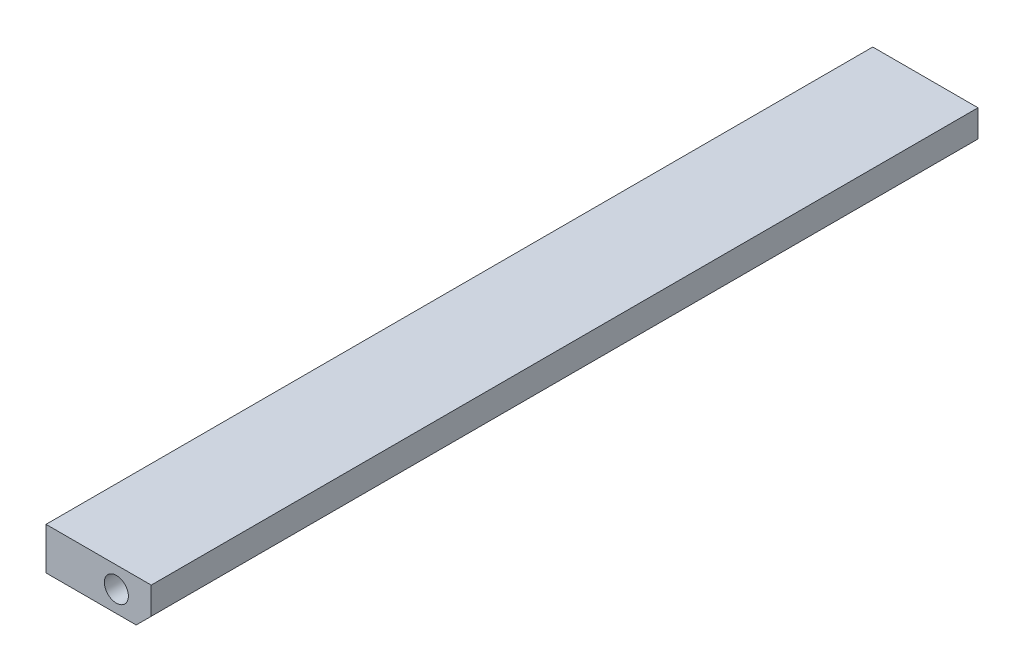
ISO-10303-21;
HEADER;
FILE_DESCRIPTION(('STEP AP214'),'2;1');
FILE_NAME('part.step','',(''),(''),'','','');
FILE_SCHEMA(('AUTOMOTIVE_DESIGN { 1 0 10303 214 1 1 1 1 }'));
ENDSEC;
DATA;
#1=APPLICATION_CONTEXT('core data for automotive mechanical design processes');
#2=APPLICATION_PROTOCOL_DEFINITION('international standard','automotive_design',2000,#1);
#3=PRODUCT_CONTEXT('',#1,'mechanical');
#4=PRODUCT('Part','Part','',(#3));
#5=PRODUCT_RELATED_PRODUCT_CATEGORY('part','',(#4));
#6=PRODUCT_DEFINITION_FORMATION('','',#4);
#7=PRODUCT_DEFINITION_CONTEXT('part definition',#1,'design');
#8=PRODUCT_DEFINITION('design','',#6,#7);
#9=PRODUCT_DEFINITION_SHAPE('','',#8);
#10=(LENGTH_UNIT() NAMED_UNIT(*) SI_UNIT(.MILLI.,.METRE.));
#11=(NAMED_UNIT(*) PLANE_ANGLE_UNIT() SI_UNIT($,.RADIAN.));
#12=(NAMED_UNIT(*) SI_UNIT($,.STERADIAN.) SOLID_ANGLE_UNIT());
#13=UNCERTAINTY_MEASURE_WITH_UNIT(LENGTH_MEASURE(1.E-05),#10,'distance_accuracy_value','');
#14=(GEOMETRIC_REPRESENTATION_CONTEXT(3) GLOBAL_UNCERTAINTY_ASSIGNED_CONTEXT((#13)) GLOBAL_UNIT_ASSIGNED_CONTEXT((#10,
#11,#12)) REPRESENTATION_CONTEXT('',''));
#15=CARTESIAN_POINT('',(0.,0.,0.));
#16=DIRECTION('',(0.,0.,1.));
#17=DIRECTION('',(1.,0.,0.));
#18=AXIS2_PLACEMENT_3D('',#15,#16,#17);
#19=CARTESIAN_POINT('',(17.5,-7.,275.));
#20=DIRECTION('',(-1.,0.,0.));
#21=DIRECTION('',(0.,0.,1.));
#22=AXIS2_PLACEMENT_3D('',#19,#20,#21);
#23=PLANE('',#22);
#24=DIRECTION('',(0.,1.,0.));
#25=VECTOR('',#24,1.);
#26=CARTESIAN_POINT('',(17.5,-7.,275.));
#27=LINE('',#26,#25);
#28=CARTESIAN_POINT('',(17.5,-1.99999999999994,275.));
#29=VERTEX_POINT('',#28);
#30=CARTESIAN_POINT('',(17.5,7.,275.));
#31=VERTEX_POINT('',#30);
#32=EDGE_CURVE('E81',#29,#31,#27,.T.);
#33=ORIENTED_EDGE('',*,*,#32,.F.);
#34=DIRECTION('',(0.,0.,-1.));
#35=VECTOR('',#34,1.);
#36=CARTESIAN_POINT('',(17.5,-1.99999999999994,275.));
#37=LINE('',#36,#35);
#38=CARTESIAN_POINT('',(17.5,-1.99999999999994,0.));
#39=VERTEX_POINT('',#38);
#40=EDGE_CURVE('E104',#29,#39,#37,.T.);
#41=ORIENTED_EDGE('',*,*,#40,.T.);
#42=DIRECTION('',(0.,1.,0.));
#43=VECTOR('',#42,1.);
#44=CARTESIAN_POINT('',(17.5,-7.,0.));
#45=LINE('',#44,#43);
#46=CARTESIAN_POINT('',(17.5,7.,0.));
#47=VERTEX_POINT('',#46);
#48=EDGE_CURVE('E102',#39,#47,#45,.T.);
#49=ORIENTED_EDGE('',*,*,#48,.T.);
#50=DIRECTION('',(0.,0.,-1.));
#51=VECTOR('',#50,1.);
#52=CARTESIAN_POINT('',(17.5,7.,275.));
#53=LINE('',#52,#51);
#54=EDGE_CURVE('E96',#31,#47,#53,.T.);
#55=ORIENTED_EDGE('',*,*,#54,.F.);
#56=EDGE_LOOP('',(#33,#41,#49,#55));
#57=FACE_BOUND('',#56,.T.);
#58=ADVANCED_FACE('F35',(#57),#23,.F.);
#59=CARTESIAN_POINT('',(-17.5,7.,275.));
#60=DIRECTION('',(0.,-1.,0.));
#61=DIRECTION('',(0.,0.,-1.));
#62=AXIS2_PLACEMENT_3D('',#59,#60,#61);
#63=PLANE('',#62);
#64=DIRECTION('',(-1.,0.,0.));
#65=VECTOR('',#64,1.);
#66=CARTESIAN_POINT('',(-17.5,7.,0.));
#67=LINE('',#66,#65);
#68=CARTESIAN_POINT('',(-17.5,7.,0.));
#69=VERTEX_POINT('',#68);
#70=EDGE_CURVE('E117',#47,#69,#67,.T.);
#71=ORIENTED_EDGE('',*,*,#70,.T.);
#72=DIRECTION('',(0.,0.,-1.));
#73=VECTOR('',#72,1.);
#74=CARTESIAN_POINT('',(-17.5,7.,275.));
#75=LINE('',#74,#73);
#76=CARTESIAN_POINT('',(-17.5,7.,275.));
#77=VERTEX_POINT('',#76);
#78=EDGE_CURVE('E98',#77,#69,#75,.T.);
#79=ORIENTED_EDGE('',*,*,#78,.F.);
#80=DIRECTION('',(-1.,0.,0.));
#81=VECTOR('',#80,1.);
#82=CARTESIAN_POINT('',(-17.5,7.,275.));
#83=LINE('',#82,#81);
#84=EDGE_CURVE('E84',#31,#77,#83,.T.);
#85=ORIENTED_EDGE('',*,*,#84,.F.);
#86=ORIENTED_EDGE('',*,*,#54,.T.);
#87=EDGE_LOOP('',(#71,#79,#85,#86));
#88=FACE_BOUND('',#87,.T.);
#89=ADVANCED_FACE('F95',(#88),#63,.F.);
#90=CARTESIAN_POINT('',(-17.5,-7.,275.));
#91=DIRECTION('',(1.,0.,0.));
#92=DIRECTION('',(0.,0.,-1.));
#93=AXIS2_PLACEMENT_3D('',#90,#91,#92);
#94=PLANE('',#93);
#95=DIRECTION('',(0.,-1.,0.));
#96=VECTOR('',#95,1.);
#97=CARTESIAN_POINT('',(-17.5,-7.,0.));
#98=LINE('',#97,#96);
#99=CARTESIAN_POINT('',(-17.5,-7.,0.));
#100=VERTEX_POINT('',#99);
#101=EDGE_CURVE('E115',#69,#100,#98,.T.);
#102=ORIENTED_EDGE('',*,*,#101,.T.);
#103=DIRECTION('',(0.,0.,-1.));
#104=VECTOR('',#103,1.);
#105=CARTESIAN_POINT('',(-17.5,-7.,275.));
#106=LINE('',#105,#104);
#107=CARTESIAN_POINT('',(-17.5,-7.,275.));
#108=VERTEX_POINT('',#107);
#109=EDGE_CURVE('E107',#108,#100,#106,.T.);
#110=ORIENTED_EDGE('',*,*,#109,.F.);
#111=DIRECTION('',(0.,-1.,0.));
#112=VECTOR('',#111,1.);
#113=CARTESIAN_POINT('',(-17.5,-7.,275.));
#114=LINE('',#113,#112);
#115=EDGE_CURVE('E100',#77,#108,#114,.T.);
#116=ORIENTED_EDGE('',*,*,#115,.F.);
#117=ORIENTED_EDGE('',*,*,#78,.T.);
#118=EDGE_LOOP('',(#102,#110,#116,#117));
#119=FACE_BOUND('',#118,.T.);
#120=ADVANCED_FACE('F150',(#119),#94,.F.);
#121=CARTESIAN_POINT('',(-17.5,-7.,275.));
#122=DIRECTION('',(0.,1.,0.));
#123=DIRECTION('',(0.,0.,1.));
#124=AXIS2_PLACEMENT_3D('',#121,#122,#123);
#125=PLANE('',#124);
#126=DIRECTION('',(1.,0.,0.));
#127=VECTOR('',#126,1.);
#128=CARTESIAN_POINT('',(-17.5,-7.,0.));
#129=LINE('',#128,#127);
#130=CARTESIAN_POINT('',(12.4999999999999,-7.,0.));
#131=VERTEX_POINT('',#130);
#132=EDGE_CURVE('E91',#100,#131,#129,.T.);
#133=ORIENTED_EDGE('',*,*,#132,.T.);
#134=DIRECTION('',(0.,0.,1.));
#135=VECTOR('',#134,1.);
#136=CARTESIAN_POINT('',(12.4999999999999,-7.,275.));
#137=LINE('',#136,#135);
#138=CARTESIAN_POINT('',(12.4999999999999,-7.,275.));
#139=VERTEX_POINT('',#138);
#140=EDGE_CURVE('E43',#131,#139,#137,.T.);
#141=ORIENTED_EDGE('',*,*,#140,.T.);
#142=DIRECTION('',(1.,0.,0.));
#143=VECTOR('',#142,1.);
#144=CARTESIAN_POINT('',(-17.5,-7.,275.));
#145=LINE('',#144,#143);
#146=EDGE_CURVE('E113',#108,#139,#145,.T.);
#147=ORIENTED_EDGE('',*,*,#146,.F.);
#148=ORIENTED_EDGE('',*,*,#109,.T.);
#149=EDGE_LOOP('',(#133,#141,#147,#148));
#150=FACE_BOUND('',#149,.T.);
#151=ADVANCED_FACE('F155',(#150),#125,.F.);
#152=CARTESIAN_POINT('',(0.,0.,275.));
#153=DIRECTION('',(0.,0.,-1.));
#154=DIRECTION('',(-1.,0.,0.));
#155=AXIS2_PLACEMENT_3D('',#152,#153,#154);
#156=PLANE('',#155);
#157=CARTESIAN_POINT('',(5.89999999999999,0.,275.));
#158=DIRECTION('',(0.,0.,1.));
#159=DIRECTION('',(1.,0.,0.));
#160=AXIS2_PLACEMENT_3D('',#157,#158,#159);
#161=CIRCLE('',#160,4.);
#162=CARTESIAN_POINT('',(9.89999999999999,0.,275.));
#163=VERTEX_POINT('',#162);
#164=EDGE_CURVE('E123',#163,#163,#161,.T.);
#165=ORIENTED_EDGE('',*,*,#164,.F.);
#166=EDGE_LOOP('',(#165));
#167=FACE_BOUND('',#166,.T.);
#168=ORIENTED_EDGE('',*,*,#146,.T.);
#169=DIRECTION('',(-0.70710678118655,-0.707106781186546,0.));
#170=VECTOR('',#169,1.);
#171=CARTESIAN_POINT('',(17.5,-1.99999999999994,275.));
#172=LINE('',#171,#170);
#173=EDGE_CURVE('E11',#139,#29,#172,.F.);
#174=ORIENTED_EDGE('',*,*,#173,.T.);
#175=ORIENTED_EDGE('',*,*,#32,.T.);
#176=ORIENTED_EDGE('',*,*,#84,.T.);
#177=ORIENTED_EDGE('',*,*,#115,.T.);
#178=EDGE_LOOP('',(#168,#174,#175,#176,#177));
#179=FACE_BOUND('',#178,.T.);
#180=ADVANCED_FACE('F83',(#167,#179),#156,.F.);
#181=CARTESIAN_POINT('',(0.,0.,0.));
#182=DIRECTION('',(0.,0.,-1.));
#183=DIRECTION('',(-1.,0.,0.));
#184=AXIS2_PLACEMENT_3D('',#181,#182,#183);
#185=PLANE('',#184);
#186=CARTESIAN_POINT('',(5.89999999999999,0.,0.));
#187=DIRECTION('',(0.,0.,1.));
#188=DIRECTION('',(1.,0.,0.));
#189=AXIS2_PLACEMENT_3D('',#186,#187,#188);
#190=CIRCLE('',#189,4.);
#191=CARTESIAN_POINT('',(9.89999999999999,0.,0.));
#192=VERTEX_POINT('',#191);
#193=EDGE_CURVE('E129',#192,#192,#190,.T.);
#194=ORIENTED_EDGE('',*,*,#193,.T.);
#195=EDGE_LOOP('',(#194));
#196=FACE_BOUND('',#195,.T.);
#197=ORIENTED_EDGE('',*,*,#48,.F.);
#198=DIRECTION('',(0.70710678118655,0.707106781186546,0.));
#199=VECTOR('',#198,1.);
#200=CARTESIAN_POINT('',(9.74999999999992,-9.74999999999998,0.));
#201=LINE('',#200,#199);
#202=EDGE_CURVE('E57',#39,#131,#201,.F.);
#203=ORIENTED_EDGE('',*,*,#202,.T.);
#204=ORIENTED_EDGE('',*,*,#132,.F.);
#205=ORIENTED_EDGE('',*,*,#101,.F.);
#206=ORIENTED_EDGE('',*,*,#70,.F.);
#207=EDGE_LOOP('',(#197,#203,#204,#205,#206));
#208=FACE_BOUND('',#207,.T.);
#209=ADVANCED_FACE('F159',(#196,#208),#185,.T.);
#210=CARTESIAN_POINT('',(17.5,-1.99999999999994,275.));
#211=DIRECTION('',(-0.707106781186545,0.707106781186549,0.));
#212=DIRECTION('',(0.,0.,-1.));
#213=AXIS2_PLACEMENT_3D('',#210,#211,#212);
#214=PLANE('',#213);
#215=ORIENTED_EDGE('',*,*,#173,.F.);
#216=ORIENTED_EDGE('',*,*,#140,.F.);
#217=ORIENTED_EDGE('',*,*,#202,.F.);
#218=ORIENTED_EDGE('',*,*,#40,.F.);
#219=EDGE_LOOP('',(#215,#216,#217,#218));
#220=FACE_BOUND('',#219,.T.);
#221=ADVANCED_FACE('F37',(#220),#214,.F.);
#222=CARTESIAN_POINT('',(5.89999999999999,0.,265.));
#223=DIRECTION('',(0.,0.,1.));
#224=DIRECTION('',(1.,0.,0.));
#225=AXIS2_PLACEMENT_3D('',#222,#223,#224);
#226=CYLINDRICAL_SURFACE('',#225,4.);
#227=CARTESIAN_POINT('',(5.89999999999999,0.,265.));
#228=DIRECTION('',(0.,0.,1.));
#229=DIRECTION('',(1.,0.,0.));
#230=AXIS2_PLACEMENT_3D('',#227,#228,#229);
#231=CIRCLE('',#230,4.);
#232=CARTESIAN_POINT('',(9.89999999999999,0.,265.));
#233=VERTEX_POINT('',#232);
#234=EDGE_CURVE('E120',#233,#233,#231,.T.);
#235=ORIENTED_EDGE('',*,*,#234,.F.);
#236=EDGE_LOOP('',(#235));
#237=FACE_BOUND('',#236,.T.);
#238=ORIENTED_EDGE('',*,*,#164,.T.);
#239=EDGE_LOOP('',(#238));
#240=FACE_BOUND('',#239,.T.);
#241=ADVANCED_FACE('F166',(#237,#240),#226,.F.);
#242=CARTESIAN_POINT('',(5.89999999999999,0.,265.));
#243=DIRECTION('',(0.,0.,1.));
#244=DIRECTION('',(1.,0.,0.));
#245=AXIS2_PLACEMENT_3D('',#242,#243,#244);
#246=PLANE('',#245);
#247=ORIENTED_EDGE('',*,*,#234,.T.);
#248=EDGE_LOOP('',(#247));
#249=FACE_BOUND('',#248,.T.);
#250=ADVANCED_FACE('F144',(#249),#246,.T.);
#251=CARTESIAN_POINT('',(5.89999999999999,0.,10.));
#252=DIRECTION('',(0.,0.,-1.));
#253=DIRECTION('',(-1.,0.,0.));
#254=AXIS2_PLACEMENT_3D('',#251,#252,#253);
#255=CYLINDRICAL_SURFACE('',#254,4.);
#256=CARTESIAN_POINT('',(5.89999999999999,0.,10.));
#257=DIRECTION('',(0.,0.,1.));
#258=DIRECTION('',(1.,0.,0.));
#259=AXIS2_PLACEMENT_3D('',#256,#257,#258);
#260=CIRCLE('',#259,4.);
#261=CARTESIAN_POINT('',(9.89999999999999,0.,10.));
#262=VERTEX_POINT('',#261);
#263=EDGE_CURVE('E126',#262,#262,#260,.T.);
#264=ORIENTED_EDGE('',*,*,#263,.T.);
#265=EDGE_LOOP('',(#264));
#266=FACE_BOUND('',#265,.T.);
#267=ORIENTED_EDGE('',*,*,#193,.F.);
#268=EDGE_LOOP('',(#267));
#269=FACE_BOUND('',#268,.T.);
#270=ADVANCED_FACE('F135',(#266,#269),#255,.F.);
#271=CARTESIAN_POINT('',(5.89999999999999,0.,10.));
#272=DIRECTION('',(0.,0.,-1.));
#273=DIRECTION('',(1.,0.,0.));
#274=AXIS2_PLACEMENT_3D('',#271,#272,#273);
#275=PLANE('',#274);
#276=ORIENTED_EDGE('',*,*,#263,.F.);
#277=EDGE_LOOP('',(#276));
#278=FACE_BOUND('',#277,.T.);
#279=ADVANCED_FACE('F138',(#278),#275,.T.);
#280=CLOSED_SHELL('',(#58,#89,#120,#151,#180,#209,#221,#241,#250,#270,#279));
#281=MANIFOLD_SOLID_BREP('B2',#280);
#282=ADVANCED_BREP_SHAPE_REPRESENTATION('',(#18,#281),#14);
#283=SHAPE_DEFINITION_REPRESENTATION(#9,#282);
ENDSEC;
END-ISO-10303-21;
